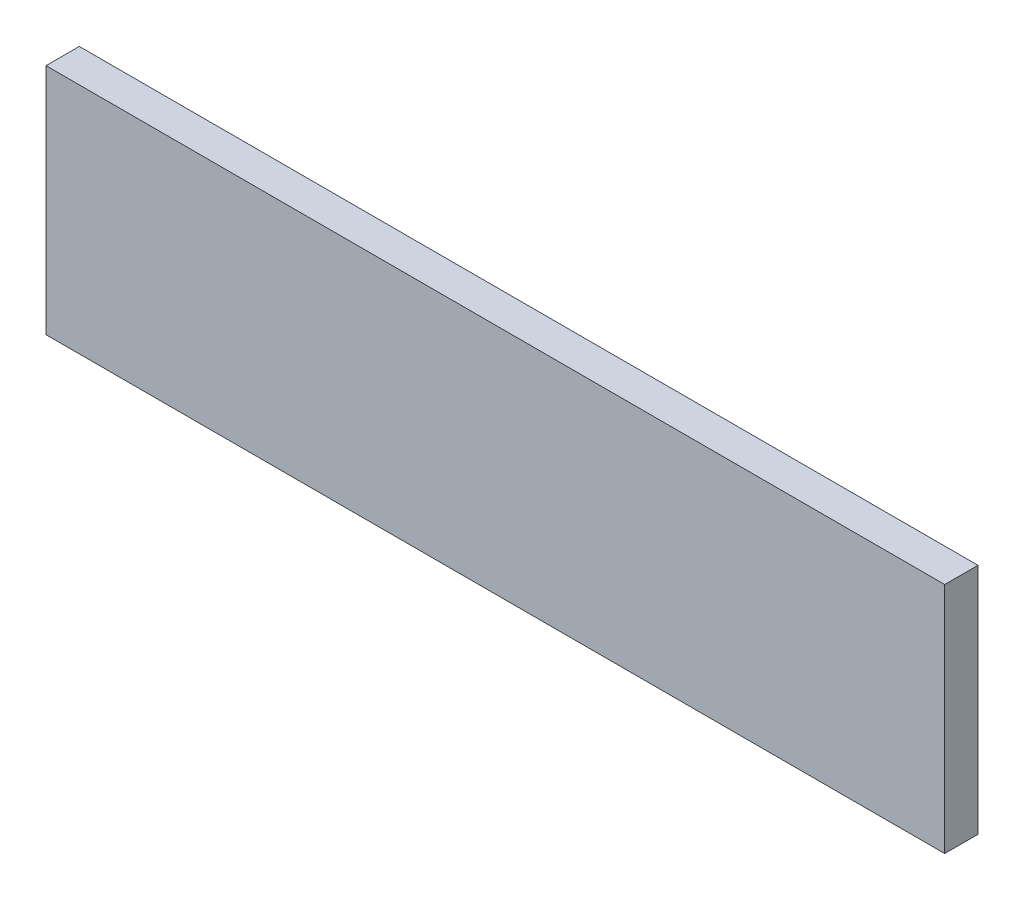
ISO-10303-21;
HEADER;
FILE_DESCRIPTION(('STEP AP214'),'2;1');
FILE_NAME('part.step','',(''),(''),'','','');
FILE_SCHEMA(('AUTOMOTIVE_DESIGN { 1 0 10303 214 1 1 1 1 }'));
ENDSEC;
DATA;
#1=APPLICATION_CONTEXT('core data for automotive mechanical design processes');
#2=APPLICATION_PROTOCOL_DEFINITION('international standard','automotive_design',2000,#1);
#3=PRODUCT_CONTEXT('',#1,'mechanical');
#4=PRODUCT('Part','Part','',(#3));
#5=PRODUCT_RELATED_PRODUCT_CATEGORY('part','',(#4));
#6=PRODUCT_DEFINITION_FORMATION('','',#4);
#7=PRODUCT_DEFINITION_CONTEXT('part definition',#1,'design');
#8=PRODUCT_DEFINITION('design','',#6,#7);
#9=PRODUCT_DEFINITION_SHAPE('','',#8);
#10=(LENGTH_UNIT() NAMED_UNIT(*) SI_UNIT(.MILLI.,.METRE.));
#11=(NAMED_UNIT(*) PLANE_ANGLE_UNIT() SI_UNIT($,.RADIAN.));
#12=(NAMED_UNIT(*) SI_UNIT($,.STERADIAN.) SOLID_ANGLE_UNIT());
#13=UNCERTAINTY_MEASURE_WITH_UNIT(LENGTH_MEASURE(1.E-05),#10,'distance_accuracy_value','');
#14=(GEOMETRIC_REPRESENTATION_CONTEXT(3) GLOBAL_UNCERTAINTY_ASSIGNED_CONTEXT((#13)) GLOBAL_UNIT_ASSIGNED_CONTEXT((#10,
#11,#12)) REPRESENTATION_CONTEXT('',''));
#15=CARTESIAN_POINT('',(0.,0.,0.));
#16=DIRECTION('',(0.,0.,1.));
#17=DIRECTION('',(1.,0.,0.));
#18=AXIS2_PLACEMENT_3D('',#15,#16,#17);
#19=CARTESIAN_POINT('',(0.,0.,10.));
#20=DIRECTION('',(0.,1.,0.));
#21=DIRECTION('',(0.,0.,1.));
#22=AXIS2_PLACEMENT_3D('',#19,#20,#21);
#23=PLANE('',#22);
#24=DIRECTION('',(1.,0.,0.));
#25=VECTOR('',#24,1.);
#26=CARTESIAN_POINT('',(0.,0.,10.));
#27=LINE('',#26,#25);
#28=CARTESIAN_POINT('',(200.,0.,10.));
#29=VERTEX_POINT('',#28);
#30=CARTESIAN_POINT('',(470.,0.,10.));
#31=VERTEX_POINT('',#30);
#32=EDGE_CURVE('E11',#29,#31,#27,.T.);
#33=ORIENTED_EDGE('',*,*,#32,.F.);
#34=DIRECTION('',(0.,0.,-1.));
#35=VECTOR('',#34,1.);
#36=CARTESIAN_POINT('',(200.,0.,10.001));
#37=LINE('',#36,#35);
#38=CARTESIAN_POINT('',(200.,0.,0.));
#39=VERTEX_POINT('',#38);
#40=EDGE_CURVE('E98',#29,#39,#37,.T.);
#41=ORIENTED_EDGE('',*,*,#40,.T.);
#42=DIRECTION('',(1.,0.,0.));
#43=VECTOR('',#42,1.);
#44=CARTESIAN_POINT('',(0.,0.,0.));
#45=LINE('',#44,#43);
#46=CARTESIAN_POINT('',(470.,0.,0.));
#47=VERTEX_POINT('',#46);
#48=EDGE_CURVE('E36',#39,#47,#45,.T.);
#49=ORIENTED_EDGE('',*,*,#48,.T.);
#50=DIRECTION('',(0.,0.,-1.));
#51=VECTOR('',#50,1.);
#52=CARTESIAN_POINT('',(470.,0.,10.001));
#53=LINE('',#52,#51);
#54=EDGE_CURVE('E47',#31,#47,#53,.T.);
#55=ORIENTED_EDGE('',*,*,#54,.F.);
#56=EDGE_LOOP('',(#33,#41,#49,#55));
#57=FACE_BOUND('',#56,.T.);
#58=ADVANCED_FACE('F33',(#57),#23,.F.);
#59=CARTESIAN_POINT('',(0.,0.,10.));
#60=DIRECTION('',(0.,0.,-1.));
#61=DIRECTION('',(-1.,0.,0.));
#62=AXIS2_PLACEMENT_3D('',#59,#60,#61);
#63=PLANE('',#62);
#64=DIRECTION('',(0.,-1.,0.));
#65=VECTOR('',#64,1.);
#66=CARTESIAN_POINT('',(470.,50.,10.));
#67=LINE('',#66,#65);
#68=CARTESIAN_POINT('',(470.,70.,10.));
#69=VERTEX_POINT('',#68);
#70=EDGE_CURVE('E64',#69,#31,#67,.T.);
#71=ORIENTED_EDGE('',*,*,#70,.F.);
#72=DIRECTION('',(1.,0.,0.));
#73=VECTOR('',#72,1.);
#74=CARTESIAN_POINT('',(470.,70.,10.));
#75=LINE('',#74,#73);
#76=CARTESIAN_POINT('',(200.,70.,10.));
#77=VERTEX_POINT('',#76);
#78=EDGE_CURVE('E92',#77,#69,#75,.T.);
#79=ORIENTED_EDGE('',*,*,#78,.F.);
#80=DIRECTION('',(0.,1.,0.));
#81=VECTOR('',#80,1.);
#82=CARTESIAN_POINT('',(200.,60.,10.));
#83=LINE('',#82,#81);
#84=EDGE_CURVE('E100',#29,#77,#83,.T.);
#85=ORIENTED_EDGE('',*,*,#84,.F.);
#86=ORIENTED_EDGE('',*,*,#32,.T.);
#87=EDGE_LOOP('',(#71,#79,#85,#86));
#88=FACE_BOUND('',#87,.T.);
#89=ADVANCED_FACE('F107',(#88),#63,.F.);
#90=CARTESIAN_POINT('',(0.,0.,0.));
#91=DIRECTION('',(0.,0.,-1.));
#92=DIRECTION('',(-1.,0.,0.));
#93=AXIS2_PLACEMENT_3D('',#90,#91,#92);
#94=PLANE('',#93);
#95=DIRECTION('',(0.,-1.,0.));
#96=VECTOR('',#95,1.);
#97=CARTESIAN_POINT('',(200.,60.,0.));
#98=LINE('',#97,#96);
#99=CARTESIAN_POINT('',(200.,70.,0.));
#100=VERTEX_POINT('',#99);
#101=EDGE_CURVE('E56',#100,#39,#98,.T.);
#102=ORIENTED_EDGE('',*,*,#101,.F.);
#103=DIRECTION('',(-1.,0.,0.));
#104=VECTOR('',#103,1.);
#105=CARTESIAN_POINT('',(470.,70.,0.));
#106=LINE('',#105,#104);
#107=CARTESIAN_POINT('',(470.,70.,0.));
#108=VERTEX_POINT('',#107);
#109=EDGE_CURVE('E85',#108,#100,#106,.T.);
#110=ORIENTED_EDGE('',*,*,#109,.F.);
#111=DIRECTION('',(0.,1.,0.));
#112=VECTOR('',#111,1.);
#113=CARTESIAN_POINT('',(470.,50.,0.));
#114=LINE('',#113,#112);
#115=EDGE_CURVE('E75',#47,#108,#114,.T.);
#116=ORIENTED_EDGE('',*,*,#115,.F.);
#117=ORIENTED_EDGE('',*,*,#48,.F.);
#118=EDGE_LOOP('',(#102,#110,#116,#117));
#119=FACE_BOUND('',#118,.T.);
#120=ADVANCED_FACE('F86',(#119),#94,.T.);
#121=CARTESIAN_POINT('',(470.,50.,10.001));
#122=DIRECTION('',(-1.,0.,0.));
#123=DIRECTION('',(0.,0.,1.));
#124=AXIS2_PLACEMENT_3D('',#121,#122,#123);
#125=PLANE('',#124);
#126=ORIENTED_EDGE('',*,*,#70,.T.);
#127=ORIENTED_EDGE('',*,*,#54,.T.);
#128=ORIENTED_EDGE('',*,*,#115,.T.);
#129=DIRECTION('',(0.,0.,-1.));
#130=VECTOR('',#129,1.);
#131=CARTESIAN_POINT('',(470.,70.,0.));
#132=LINE('',#131,#130);
#133=EDGE_CURVE('E79',#69,#108,#132,.T.);
#134=ORIENTED_EDGE('',*,*,#133,.F.);
#135=EDGE_LOOP('',(#126,#127,#128,#134));
#136=FACE_BOUND('',#135,.T.);
#137=ADVANCED_FACE('F77',(#136),#125,.F.);
#138=CARTESIAN_POINT('',(200.,60.,10.001));
#139=DIRECTION('',(1.,0.,0.));
#140=DIRECTION('',(0.,0.,-1.));
#141=AXIS2_PLACEMENT_3D('',#138,#139,#140);
#142=PLANE('',#141);
#143=ORIENTED_EDGE('',*,*,#84,.T.);
#144=DIRECTION('',(0.,0.,1.));
#145=VECTOR('',#144,1.);
#146=CARTESIAN_POINT('',(200.,70.,0.));
#147=LINE('',#146,#145);
#148=EDGE_CURVE('E89',#100,#77,#147,.T.);
#149=ORIENTED_EDGE('',*,*,#148,.F.);
#150=ORIENTED_EDGE('',*,*,#101,.T.);
#151=ORIENTED_EDGE('',*,*,#40,.F.);
#152=EDGE_LOOP('',(#143,#149,#150,#151));
#153=FACE_BOUND('',#152,.T.);
#154=ADVANCED_FACE('F106',(#153),#142,.F.);
#155=CARTESIAN_POINT('',(0.,70.,0.));
#156=DIRECTION('',(0.,-1.,0.));
#157=DIRECTION('',(0.,0.,-1.));
#158=AXIS2_PLACEMENT_3D('',#155,#156,#157);
#159=PLANE('',#158);
#160=ORIENTED_EDGE('',*,*,#133,.T.);
#161=ORIENTED_EDGE('',*,*,#109,.T.);
#162=ORIENTED_EDGE('',*,*,#148,.T.);
#163=ORIENTED_EDGE('',*,*,#78,.T.);
#164=EDGE_LOOP('',(#160,#161,#162,#163));
#165=FACE_BOUND('',#164,.T.);
#166=ADVANCED_FACE('F91',(#165),#159,.F.);
#167=CLOSED_SHELL('',(#58,#89,#120,#137,#154,#166));
#168=MANIFOLD_SOLID_BREP('B2',#167);
#169=ADVANCED_BREP_SHAPE_REPRESENTATION('',(#18,#168),#14);
#170=SHAPE_DEFINITION_REPRESENTATION(#9,#169);
ENDSEC;
END-ISO-10303-21;
